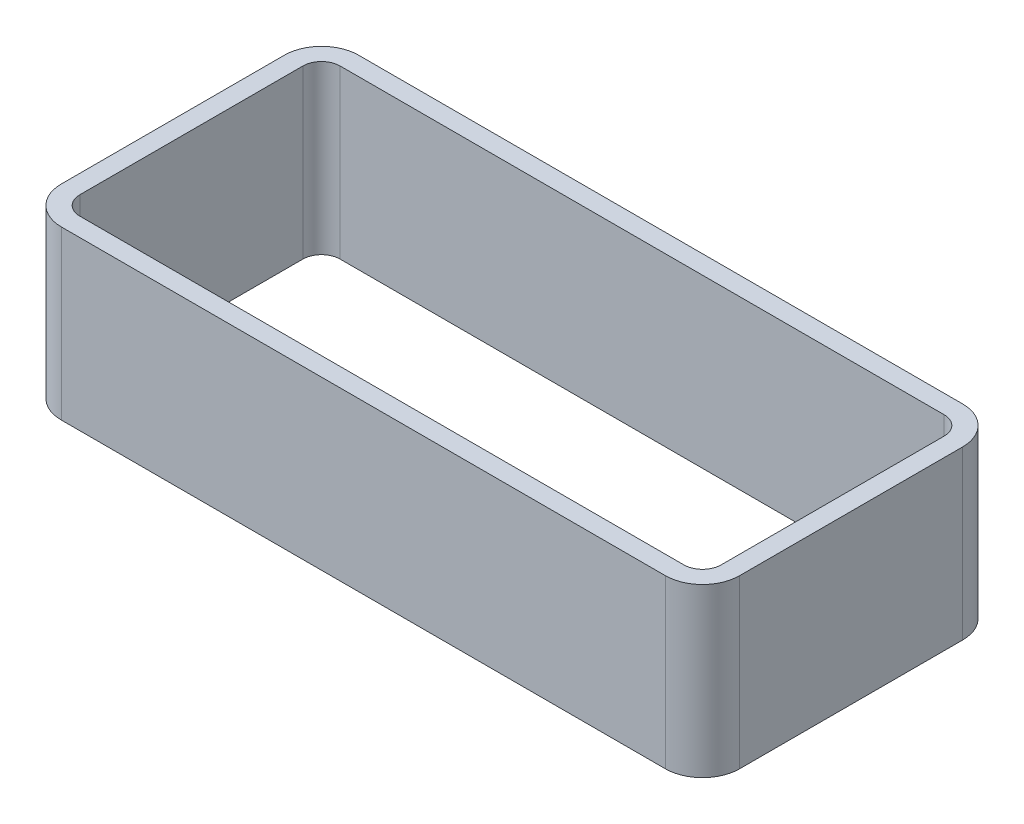
ISO-10303-21;
HEADER;
FILE_DESCRIPTION(('STEP AP214'),'2;1');
FILE_NAME('part.step','',(''),(''),'','','');
FILE_SCHEMA(('AUTOMOTIVE_DESIGN { 1 0 10303 214 1 1 1 1 }'));
ENDSEC;
DATA;
#1=APPLICATION_CONTEXT('core data for automotive mechanical design processes');
#2=APPLICATION_PROTOCOL_DEFINITION('international standard','automotive_design',2000,#1);
#3=PRODUCT_CONTEXT('',#1,'mechanical');
#4=PRODUCT('Part','Part','',(#3));
#5=PRODUCT_RELATED_PRODUCT_CATEGORY('part','',(#4));
#6=PRODUCT_DEFINITION_FORMATION('','',#4);
#7=PRODUCT_DEFINITION_CONTEXT('part definition',#1,'design');
#8=PRODUCT_DEFINITION('design','',#6,#7);
#9=PRODUCT_DEFINITION_SHAPE('','',#8);
#10=(LENGTH_UNIT() NAMED_UNIT(*) SI_UNIT(.MILLI.,.METRE.));
#11=(NAMED_UNIT(*) PLANE_ANGLE_UNIT() SI_UNIT($,.RADIAN.));
#12=(NAMED_UNIT(*) SI_UNIT($,.STERADIAN.) SOLID_ANGLE_UNIT());
#13=UNCERTAINTY_MEASURE_WITH_UNIT(LENGTH_MEASURE(1.E-05),#10,'distance_accuracy_value','');
#14=(GEOMETRIC_REPRESENTATION_CONTEXT(3) GLOBAL_UNCERTAINTY_ASSIGNED_CONTEXT((#13)) GLOBAL_UNIT_ASSIGNED_CONTEXT((#10,
#11,#12)) REPRESENTATION_CONTEXT('',''));
#15=CARTESIAN_POINT('',(0.,0.,0.));
#16=DIRECTION('',(0.,0.,1.));
#17=DIRECTION('',(1.,0.,0.));
#18=AXIS2_PLACEMENT_3D('',#15,#16,#17);
#19=CARTESIAN_POINT('',(-32.5,18.,12.));
#20=DIRECTION('',(0.,-1.,0.));
#21=DIRECTION('',(0.,0.,-1.));
#22=AXIS2_PLACEMENT_3D('',#19,#20,#21);
#23=PLANE('',#22);
#24=CARTESIAN_POINT('',(-32.5,18.,12.));
#25=DIRECTION('',(0.,1.,0.));
#26=DIRECTION('',(0.,0.,-1.));
#27=AXIS2_PLACEMENT_3D('',#24,#25,#26);
#28=CIRCLE('',#27,4.);
#29=CARTESIAN_POINT('',(-36.5,18.,12.));
#30=VERTEX_POINT('',#29);
#31=CARTESIAN_POINT('',(-32.5,18.,16.));
#32=VERTEX_POINT('',#31);
#33=EDGE_CURVE('E211',#30,#32,#28,.T.);
#34=ORIENTED_EDGE('',*,*,#33,.T.);
#35=DIRECTION('',(1.,0.,0.));
#36=VECTOR('',#35,1.);
#37=CARTESIAN_POINT('',(-32.5,18.,16.));
#38=LINE('',#37,#36);
#39=CARTESIAN_POINT('',(32.5,18.,16.));
#40=VERTEX_POINT('',#39);
#41=EDGE_CURVE('E214',#32,#40,#38,.T.);
#42=ORIENTED_EDGE('',*,*,#41,.T.);
#43=CARTESIAN_POINT('',(32.5,18.,12.));
#44=DIRECTION('',(0.,1.,0.));
#45=DIRECTION('',(0.,0.,-1.));
#46=AXIS2_PLACEMENT_3D('',#43,#44,#45);
#47=CIRCLE('',#46,4.);
#48=CARTESIAN_POINT('',(36.5,18.,12.));
#49=VERTEX_POINT('',#48);
#50=EDGE_CURVE('E217',#40,#49,#47,.T.);
#51=ORIENTED_EDGE('',*,*,#50,.T.);
#52=DIRECTION('',(0.,0.,-1.));
#53=VECTOR('',#52,1.);
#54=CARTESIAN_POINT('',(36.5,18.,12.));
#55=LINE('',#54,#53);
#56=CARTESIAN_POINT('',(36.5,18.,-12.));
#57=VERTEX_POINT('',#56);
#58=EDGE_CURVE('E219',#49,#57,#55,.T.);
#59=ORIENTED_EDGE('',*,*,#58,.T.);
#60=CARTESIAN_POINT('',(32.5,18.,-12.));
#61=DIRECTION('',(0.,1.,0.));
#62=DIRECTION('',(0.,0.,1.));
#63=AXIS2_PLACEMENT_3D('',#60,#61,#62);
#64=CIRCLE('',#63,4.);
#65=CARTESIAN_POINT('',(32.5,18.,-16.));
#66=VERTEX_POINT('',#65);
#67=EDGE_CURVE('E221',#57,#66,#64,.T.);
#68=ORIENTED_EDGE('',*,*,#67,.T.);
#69=DIRECTION('',(-1.,0.,0.));
#70=VECTOR('',#69,1.);
#71=CARTESIAN_POINT('',(-32.5,18.,-16.));
#72=LINE('',#71,#70);
#73=CARTESIAN_POINT('',(-32.5,18.,-16.));
#74=VERTEX_POINT('',#73);
#75=EDGE_CURVE('E223',#66,#74,#72,.T.);
#76=ORIENTED_EDGE('',*,*,#75,.T.);
#77=CARTESIAN_POINT('',(-32.5,18.,-12.));
#78=DIRECTION('',(0.,1.,0.));
#79=DIRECTION('',(0.,0.,1.));
#80=AXIS2_PLACEMENT_3D('',#77,#78,#79);
#81=CIRCLE('',#80,4.);
#82=CARTESIAN_POINT('',(-36.5,18.,-12.));
#83=VERTEX_POINT('',#82);
#84=EDGE_CURVE('E225',#74,#83,#81,.T.);
#85=ORIENTED_EDGE('',*,*,#84,.T.);
#86=DIRECTION('',(0.,0.,1.));
#87=VECTOR('',#86,1.);
#88=CARTESIAN_POINT('',(-36.5,18.,12.));
#89=LINE('',#88,#87);
#90=EDGE_CURVE('E227',#83,#30,#89,.T.);
#91=ORIENTED_EDGE('',*,*,#90,.T.);
#92=EDGE_LOOP('',(#34,#42,#51,#59,#68,#76,#85,#91));
#93=FACE_BOUND('',#92,.T.);
#94=CARTESIAN_POINT('',(-32.5,18.,-12.));
#95=DIRECTION('',(0.,1.,0.));
#96=DIRECTION('',(0.,0.,1.));
#97=AXIS2_PLACEMENT_3D('',#94,#95,#96);
#98=CIRCLE('',#97,2.);
#99=CARTESIAN_POINT('',(-32.5,18.,-14.));
#100=VERTEX_POINT('',#99);
#101=CARTESIAN_POINT('',(-34.5,18.,-12.));
#102=VERTEX_POINT('',#101);
#103=EDGE_CURVE('E146',#100,#102,#98,.T.);
#104=ORIENTED_EDGE('',*,*,#103,.F.);
#105=DIRECTION('',(-1.,0.,0.));
#106=VECTOR('',#105,1.);
#107=CARTESIAN_POINT('',(-32.5,18.,-14.));
#108=LINE('',#107,#106);
#109=CARTESIAN_POINT('',(32.5,18.,-14.));
#110=VERTEX_POINT('',#109);
#111=EDGE_CURVE('E179',#110,#100,#108,.T.);
#112=ORIENTED_EDGE('',*,*,#111,.F.);
#113=CARTESIAN_POINT('',(32.5,18.,-12.));
#114=DIRECTION('',(0.,1.,0.));
#115=DIRECTION('',(0.,0.,1.));
#116=AXIS2_PLACEMENT_3D('',#113,#114,#115);
#117=CIRCLE('',#116,2.);
#118=CARTESIAN_POINT('',(34.5,18.,-12.));
#119=VERTEX_POINT('',#118);
#120=EDGE_CURVE('E177',#119,#110,#117,.T.);
#121=ORIENTED_EDGE('',*,*,#120,.F.);
#122=DIRECTION('',(0.,0.,-1.));
#123=VECTOR('',#122,1.);
#124=CARTESIAN_POINT('',(34.5,18.,12.));
#125=LINE('',#124,#123);
#126=CARTESIAN_POINT('',(34.5,18.,12.));
#127=VERTEX_POINT('',#126);
#128=EDGE_CURVE('E175',#127,#119,#125,.T.);
#129=ORIENTED_EDGE('',*,*,#128,.F.);
#130=CARTESIAN_POINT('',(32.5,18.,12.));
#131=DIRECTION('',(0.,1.,0.));
#132=DIRECTION('',(0.,0.,-1.));
#133=AXIS2_PLACEMENT_3D('',#130,#131,#132);
#134=CIRCLE('',#133,2.);
#135=CARTESIAN_POINT('',(32.5,18.,14.));
#136=VERTEX_POINT('',#135);
#137=EDGE_CURVE('E173',#136,#127,#134,.T.);
#138=ORIENTED_EDGE('',*,*,#137,.F.);
#139=DIRECTION('',(1.,0.,0.));
#140=VECTOR('',#139,1.);
#141=CARTESIAN_POINT('',(-32.5,18.,14.));
#142=LINE('',#141,#140);
#143=CARTESIAN_POINT('',(-32.5,18.,14.));
#144=VERTEX_POINT('',#143);
#145=EDGE_CURVE('E169',#144,#136,#142,.T.);
#146=ORIENTED_EDGE('',*,*,#145,.F.);
#147=CARTESIAN_POINT('',(-32.5,18.,12.));
#148=DIRECTION('',(0.,1.,0.));
#149=DIRECTION('',(0.,0.,-1.));
#150=AXIS2_PLACEMENT_3D('',#147,#148,#149);
#151=CIRCLE('',#150,2.);
#152=CARTESIAN_POINT('',(-34.5,18.,12.));
#153=VERTEX_POINT('',#152);
#154=EDGE_CURVE('E167',#153,#144,#151,.T.);
#155=ORIENTED_EDGE('',*,*,#154,.F.);
#156=DIRECTION('',(0.,0.,1.));
#157=VECTOR('',#156,1.);
#158=CARTESIAN_POINT('',(-34.5,18.,12.));
#159=LINE('',#158,#157);
#160=EDGE_CURVE('E154',#102,#153,#159,.T.);
#161=ORIENTED_EDGE('',*,*,#160,.F.);
#162=EDGE_LOOP('',(#104,#112,#121,#129,#138,#146,#155,#161));
#163=FACE_BOUND('',#162,.T.);
#164=ADVANCED_FACE('F33',(#93,#163),#23,.F.);
#165=CARTESIAN_POINT('',(-32.5,0.,12.));
#166=DIRECTION('',(0.,-1.,0.));
#167=DIRECTION('',(0.,0.,-1.));
#168=AXIS2_PLACEMENT_3D('',#165,#166,#167);
#169=PLANE('',#168);
#170=CARTESIAN_POINT('',(-32.5,0.,12.));
#171=DIRECTION('',(0.,1.,0.));
#172=DIRECTION('',(0.,0.,-1.));
#173=AXIS2_PLACEMENT_3D('',#170,#171,#172);
#174=CIRCLE('',#173,4.);
#175=CARTESIAN_POINT('',(-36.5,0.,12.));
#176=VERTEX_POINT('',#175);
#177=CARTESIAN_POINT('',(-32.5,0.,16.));
#178=VERTEX_POINT('',#177);
#179=EDGE_CURVE('E162',#176,#178,#174,.T.);
#180=ORIENTED_EDGE('',*,*,#179,.F.);
#181=DIRECTION('',(0.,0.,1.));
#182=VECTOR('',#181,1.);
#183=CARTESIAN_POINT('',(-36.5,0.,12.));
#184=LINE('',#183,#182);
#185=CARTESIAN_POINT('',(-36.5,0.,-12.));
#186=VERTEX_POINT('',#185);
#187=EDGE_CURVE('E215',#186,#176,#184,.T.);
#188=ORIENTED_EDGE('',*,*,#187,.F.);
#189=CARTESIAN_POINT('',(-32.5,0.,-12.));
#190=DIRECTION('',(0.,1.,0.));
#191=DIRECTION('',(0.,0.,1.));
#192=AXIS2_PLACEMENT_3D('',#189,#190,#191);
#193=CIRCLE('',#192,4.);
#194=CARTESIAN_POINT('',(-32.5,0.,-16.));
#195=VERTEX_POINT('',#194);
#196=EDGE_CURVE('E242',#195,#186,#193,.T.);
#197=ORIENTED_EDGE('',*,*,#196,.F.);
#198=DIRECTION('',(-1.,0.,0.));
#199=VECTOR('',#198,1.);
#200=CARTESIAN_POINT('',(-32.5,0.,-16.));
#201=LINE('',#200,#199);
#202=CARTESIAN_POINT('',(32.5,0.,-16.));
#203=VERTEX_POINT('',#202);
#204=EDGE_CURVE('E240',#203,#195,#201,.T.);
#205=ORIENTED_EDGE('',*,*,#204,.F.);
#206=CARTESIAN_POINT('',(32.5,0.,-12.));
#207=DIRECTION('',(0.,1.,0.));
#208=DIRECTION('',(0.,0.,1.));
#209=AXIS2_PLACEMENT_3D('',#206,#207,#208);
#210=CIRCLE('',#209,4.);
#211=CARTESIAN_POINT('',(36.5,0.,-12.));
#212=VERTEX_POINT('',#211);
#213=EDGE_CURVE('E238',#212,#203,#210,.T.);
#214=ORIENTED_EDGE('',*,*,#213,.F.);
#215=DIRECTION('',(0.,0.,-1.));
#216=VECTOR('',#215,1.);
#217=CARTESIAN_POINT('',(36.5,0.,12.));
#218=LINE('',#217,#216);
#219=CARTESIAN_POINT('',(36.5,0.,12.));
#220=VERTEX_POINT('',#219);
#221=EDGE_CURVE('E236',#220,#212,#218,.T.);
#222=ORIENTED_EDGE('',*,*,#221,.F.);
#223=CARTESIAN_POINT('',(32.5,0.,12.));
#224=DIRECTION('',(0.,1.,0.));
#225=DIRECTION('',(0.,0.,-1.));
#226=AXIS2_PLACEMENT_3D('',#223,#224,#225);
#227=CIRCLE('',#226,4.);
#228=CARTESIAN_POINT('',(32.5,0.,16.));
#229=VERTEX_POINT('',#228);
#230=EDGE_CURVE('E234',#229,#220,#227,.T.);
#231=ORIENTED_EDGE('',*,*,#230,.F.);
#232=DIRECTION('',(1.,0.,0.));
#233=VECTOR('',#232,1.);
#234=CARTESIAN_POINT('',(-32.5,0.,16.));
#235=LINE('',#234,#233);
#236=EDGE_CURVE('E232',#178,#229,#235,.T.);
#237=ORIENTED_EDGE('',*,*,#236,.F.);
#238=EDGE_LOOP('',(#180,#188,#197,#205,#214,#222,#231,#237));
#239=FACE_BOUND('',#238,.T.);
#240=DIRECTION('',(-1.,0.,0.));
#241=VECTOR('',#240,1.);
#242=CARTESIAN_POINT('',(-32.5,0.,-14.));
#243=LINE('',#242,#241);
#244=CARTESIAN_POINT('',(32.5,0.,-14.));
#245=VERTEX_POINT('',#244);
#246=CARTESIAN_POINT('',(-32.5,0.,-14.));
#247=VERTEX_POINT('',#246);
#248=EDGE_CURVE('E155',#245,#247,#243,.T.);
#249=ORIENTED_EDGE('',*,*,#248,.T.);
#250=CARTESIAN_POINT('',(-32.5,0.,-12.));
#251=DIRECTION('',(0.,1.,0.));
#252=DIRECTION('',(0.,0.,1.));
#253=AXIS2_PLACEMENT_3D('',#250,#251,#252);
#254=CIRCLE('',#253,2.);
#255=CARTESIAN_POINT('',(-34.5,0.,-12.));
#256=VERTEX_POINT('',#255);
#257=EDGE_CURVE('E56',#247,#256,#254,.T.);
#258=ORIENTED_EDGE('',*,*,#257,.T.);
#259=DIRECTION('',(0.,0.,1.));
#260=VECTOR('',#259,1.);
#261=CARTESIAN_POINT('',(-34.5,0.,12.));
#262=LINE('',#261,#260);
#263=CARTESIAN_POINT('',(-34.5,0.,12.));
#264=VERTEX_POINT('',#263);
#265=EDGE_CURVE('E161',#256,#264,#262,.T.);
#266=ORIENTED_EDGE('',*,*,#265,.T.);
#267=CARTESIAN_POINT('',(-32.5,0.,12.));
#268=DIRECTION('',(0.,1.,0.));
#269=DIRECTION('',(0.,0.,-1.));
#270=AXIS2_PLACEMENT_3D('',#267,#268,#269);
#271=CIRCLE('',#270,2.);
#272=CARTESIAN_POINT('',(-32.5,0.,14.));
#273=VERTEX_POINT('',#272);
#274=EDGE_CURVE('E183',#264,#273,#271,.T.);
#275=ORIENTED_EDGE('',*,*,#274,.T.);
#276=DIRECTION('',(1.,0.,0.));
#277=VECTOR('',#276,1.);
#278=CARTESIAN_POINT('',(-32.5,0.,14.));
#279=LINE('',#278,#277);
#280=CARTESIAN_POINT('',(32.5,0.,14.));
#281=VERTEX_POINT('',#280);
#282=EDGE_CURVE('E186',#273,#281,#279,.T.);
#283=ORIENTED_EDGE('',*,*,#282,.T.);
#284=CARTESIAN_POINT('',(32.5,0.,12.));
#285=DIRECTION('',(0.,1.,0.));
#286=DIRECTION('',(0.,0.,-1.));
#287=AXIS2_PLACEMENT_3D('',#284,#285,#286);
#288=CIRCLE('',#287,2.);
#289=CARTESIAN_POINT('',(34.5,0.,12.));
#290=VERTEX_POINT('',#289);
#291=EDGE_CURVE('E189',#281,#290,#288,.T.);
#292=ORIENTED_EDGE('',*,*,#291,.T.);
#293=DIRECTION('',(0.,0.,-1.));
#294=VECTOR('',#293,1.);
#295=CARTESIAN_POINT('',(34.5,0.,12.));
#296=LINE('',#295,#294);
#297=CARTESIAN_POINT('',(34.5,0.,-12.));
#298=VERTEX_POINT('',#297);
#299=EDGE_CURVE('E192',#290,#298,#296,.T.);
#300=ORIENTED_EDGE('',*,*,#299,.T.);
#301=CARTESIAN_POINT('',(32.5,0.,-12.));
#302=DIRECTION('',(0.,1.,0.));
#303=DIRECTION('',(0.,0.,1.));
#304=AXIS2_PLACEMENT_3D('',#301,#302,#303);
#305=CIRCLE('',#304,2.);
#306=EDGE_CURVE('E195',#298,#245,#305,.T.);
#307=ORIENTED_EDGE('',*,*,#306,.T.);
#308=EDGE_LOOP('',(#249,#258,#266,#275,#283,#292,#300,#307));
#309=FACE_BOUND('',#308,.T.);
#310=ADVANCED_FACE('F272',(#239,#309),#169,.T.);
#311=CARTESIAN_POINT('',(-32.5,18.,12.));
#312=DIRECTION('',(0.,-1.,0.));
#313=DIRECTION('',(0.,0.,-1.));
#314=AXIS2_PLACEMENT_3D('',#311,#312,#313);
#315=CYLINDRICAL_SURFACE('',#314,4.);
#316=ORIENTED_EDGE('',*,*,#179,.T.);
#317=DIRECTION('',(0.,-1.,0.));
#318=VECTOR('',#317,1.);
#319=CARTESIAN_POINT('',(-32.5,18.,16.));
#320=LINE('',#319,#318);
#321=EDGE_CURVE('E11',#32,#178,#320,.T.);
#322=ORIENTED_EDGE('',*,*,#321,.F.);
#323=ORIENTED_EDGE('',*,*,#33,.F.);
#324=DIRECTION('',(0.,-1.,0.));
#325=VECTOR('',#324,1.);
#326=CARTESIAN_POINT('',(-36.5,18.,12.));
#327=LINE('',#326,#325);
#328=EDGE_CURVE('E229',#30,#176,#327,.T.);
#329=ORIENTED_EDGE('',*,*,#328,.T.);
#330=EDGE_LOOP('',(#316,#322,#323,#329));
#331=FACE_BOUND('',#330,.T.);
#332=ADVANCED_FACE('F35',(#331),#315,.T.);
#333=CARTESIAN_POINT('',(-32.5,18.,16.));
#334=DIRECTION('',(0.,0.,-1.));
#335=DIRECTION('',(-1.,0.,0.));
#336=AXIS2_PLACEMENT_3D('',#333,#334,#335);
#337=PLANE('',#336);
#338=ORIENTED_EDGE('',*,*,#236,.T.);
#339=DIRECTION('',(0.,-1.,0.));
#340=VECTOR('',#339,1.);
#341=CARTESIAN_POINT('',(32.5,18.,16.));
#342=LINE('',#341,#340);
#343=EDGE_CURVE('E41',#40,#229,#342,.T.);
#344=ORIENTED_EDGE('',*,*,#343,.F.);
#345=ORIENTED_EDGE('',*,*,#41,.F.);
#346=ORIENTED_EDGE('',*,*,#321,.T.);
#347=EDGE_LOOP('',(#338,#344,#345,#346));
#348=FACE_BOUND('',#347,.T.);
#349=ADVANCED_FACE('F289',(#348),#337,.F.);
#350=CARTESIAN_POINT('',(32.5,18.,12.));
#351=DIRECTION('',(0.,-1.,0.));
#352=DIRECTION('',(0.,0.,-1.));
#353=AXIS2_PLACEMENT_3D('',#350,#351,#352);
#354=CYLINDRICAL_SURFACE('',#353,4.);
#355=ORIENTED_EDGE('',*,*,#230,.T.);
#356=DIRECTION('',(0.,-1.,0.));
#357=VECTOR('',#356,1.);
#358=CARTESIAN_POINT('',(36.5,18.,12.));
#359=LINE('',#358,#357);
#360=EDGE_CURVE('E259',#49,#220,#359,.T.);
#361=ORIENTED_EDGE('',*,*,#360,.F.);
#362=ORIENTED_EDGE('',*,*,#50,.F.);
#363=ORIENTED_EDGE('',*,*,#343,.T.);
#364=EDGE_LOOP('',(#355,#361,#362,#363));
#365=FACE_BOUND('',#364,.T.);
#366=ADVANCED_FACE('F266',(#365),#354,.T.);
#367=CARTESIAN_POINT('',(36.5,18.,12.));
#368=DIRECTION('',(-1.,0.,0.));
#369=DIRECTION('',(0.,0.,1.));
#370=AXIS2_PLACEMENT_3D('',#367,#368,#369);
#371=PLANE('',#370);
#372=ORIENTED_EDGE('',*,*,#221,.T.);
#373=DIRECTION('',(0.,-1.,0.));
#374=VECTOR('',#373,1.);
#375=CARTESIAN_POINT('',(36.5,18.,-12.));
#376=LINE('',#375,#374);
#377=EDGE_CURVE('E256',#57,#212,#376,.T.);
#378=ORIENTED_EDGE('',*,*,#377,.F.);
#379=ORIENTED_EDGE('',*,*,#58,.F.);
#380=ORIENTED_EDGE('',*,*,#360,.T.);
#381=EDGE_LOOP('',(#372,#378,#379,#380));
#382=FACE_BOUND('',#381,.T.);
#383=ADVANCED_FACE('F278',(#382),#371,.F.);
#384=CARTESIAN_POINT('',(32.5,18.,-12.));
#385=DIRECTION('',(0.,-1.,0.));
#386=DIRECTION('',(0.,0.,-1.));
#387=AXIS2_PLACEMENT_3D('',#384,#385,#386);
#388=CYLINDRICAL_SURFACE('',#387,4.);
#389=ORIENTED_EDGE('',*,*,#213,.T.);
#390=DIRECTION('',(0.,-1.,0.));
#391=VECTOR('',#390,1.);
#392=CARTESIAN_POINT('',(32.5,18.,-16.));
#393=LINE('',#392,#391);
#394=EDGE_CURVE('E253',#66,#203,#393,.T.);
#395=ORIENTED_EDGE('',*,*,#394,.F.);
#396=ORIENTED_EDGE('',*,*,#67,.F.);
#397=ORIENTED_EDGE('',*,*,#377,.T.);
#398=EDGE_LOOP('',(#389,#395,#396,#397));
#399=FACE_BOUND('',#398,.T.);
#400=ADVANCED_FACE('F282',(#399),#388,.T.);
#401=CARTESIAN_POINT('',(-32.5,18.,-16.));
#402=DIRECTION('',(0.,0.,1.));
#403=DIRECTION('',(1.,0.,0.));
#404=AXIS2_PLACEMENT_3D('',#401,#402,#403);
#405=PLANE('',#404);
#406=ORIENTED_EDGE('',*,*,#204,.T.);
#407=DIRECTION('',(0.,-1.,0.));
#408=VECTOR('',#407,1.);
#409=CARTESIAN_POINT('',(-32.5,18.,-16.));
#410=LINE('',#409,#408);
#411=EDGE_CURVE('E250',#74,#195,#410,.T.);
#412=ORIENTED_EDGE('',*,*,#411,.F.);
#413=ORIENTED_EDGE('',*,*,#75,.F.);
#414=ORIENTED_EDGE('',*,*,#394,.T.);
#415=EDGE_LOOP('',(#406,#412,#413,#414));
#416=FACE_BOUND('',#415,.T.);
#417=ADVANCED_FACE('F302',(#416),#405,.F.);
#418=CARTESIAN_POINT('',(-32.5,18.,-12.));
#419=DIRECTION('',(0.,-1.,0.));
#420=DIRECTION('',(0.,0.,-1.));
#421=AXIS2_PLACEMENT_3D('',#418,#419,#420);
#422=CYLINDRICAL_SURFACE('',#421,4.);
#423=ORIENTED_EDGE('',*,*,#196,.T.);
#424=DIRECTION('',(0.,-1.,0.));
#425=VECTOR('',#424,1.);
#426=CARTESIAN_POINT('',(-36.5,18.,-12.));
#427=LINE('',#426,#425);
#428=EDGE_CURVE('E247',#83,#186,#427,.T.);
#429=ORIENTED_EDGE('',*,*,#428,.F.);
#430=ORIENTED_EDGE('',*,*,#84,.F.);
#431=ORIENTED_EDGE('',*,*,#411,.T.);
#432=EDGE_LOOP('',(#423,#429,#430,#431));
#433=FACE_BOUND('',#432,.T.);
#434=ADVANCED_FACE('F300',(#433),#422,.T.);
#435=CARTESIAN_POINT('',(-36.5,18.,12.));
#436=DIRECTION('',(1.,0.,0.));
#437=DIRECTION('',(0.,0.,-1.));
#438=AXIS2_PLACEMENT_3D('',#435,#436,#437);
#439=PLANE('',#438);
#440=ORIENTED_EDGE('',*,*,#187,.T.);
#441=ORIENTED_EDGE('',*,*,#328,.F.);
#442=ORIENTED_EDGE('',*,*,#90,.F.);
#443=ORIENTED_EDGE('',*,*,#428,.T.);
#444=EDGE_LOOP('',(#440,#441,#442,#443));
#445=FACE_BOUND('',#444,.T.);
#446=ADVANCED_FACE('F295',(#445),#439,.F.);
#447=CARTESIAN_POINT('',(-32.5,18.,-12.));
#448=DIRECTION('',(0.,-1.,0.));
#449=DIRECTION('',(0.,0.,-1.));
#450=AXIS2_PLACEMENT_3D('',#447,#448,#449);
#451=CYLINDRICAL_SURFACE('',#450,2.);
#452=ORIENTED_EDGE('',*,*,#257,.F.);
#453=DIRECTION('',(0.,-1.,0.));
#454=VECTOR('',#453,1.);
#455=CARTESIAN_POINT('',(-32.5,18.,-14.));
#456=LINE('',#455,#454);
#457=EDGE_CURVE('E150',#100,#247,#456,.T.);
#458=ORIENTED_EDGE('',*,*,#457,.F.);
#459=ORIENTED_EDGE('',*,*,#103,.T.);
#460=DIRECTION('',(0.,-1.,0.));
#461=VECTOR('',#460,1.);
#462=CARTESIAN_POINT('',(-34.5,18.,-12.));
#463=LINE('',#462,#461);
#464=EDGE_CURVE('E149',#102,#256,#463,.T.);
#465=ORIENTED_EDGE('',*,*,#464,.T.);
#466=EDGE_LOOP('',(#452,#458,#459,#465));
#467=FACE_BOUND('',#466,.T.);
#468=ADVANCED_FACE('F148',(#467),#451,.F.);
#469=CARTESIAN_POINT('',(-34.5,18.,12.));
#470=DIRECTION('',(1.,0.,0.));
#471=DIRECTION('',(0.,0.,-1.));
#472=AXIS2_PLACEMENT_3D('',#469,#470,#471);
#473=PLANE('',#472);
#474=ORIENTED_EDGE('',*,*,#265,.F.);
#475=ORIENTED_EDGE('',*,*,#464,.F.);
#476=ORIENTED_EDGE('',*,*,#160,.T.);
#477=DIRECTION('',(0.,-1.,0.));
#478=VECTOR('',#477,1.);
#479=CARTESIAN_POINT('',(-34.5,18.,12.));
#480=LINE('',#479,#478);
#481=EDGE_CURVE('E163',#153,#264,#480,.T.);
#482=ORIENTED_EDGE('',*,*,#481,.T.);
#483=EDGE_LOOP('',(#474,#475,#476,#482));
#484=FACE_BOUND('',#483,.T.);
#485=ADVANCED_FACE('F158',(#484),#473,.T.);
#486=CARTESIAN_POINT('',(-32.5,18.,12.));
#487=DIRECTION('',(0.,-1.,0.));
#488=DIRECTION('',(0.,0.,-1.));
#489=AXIS2_PLACEMENT_3D('',#486,#487,#488);
#490=CYLINDRICAL_SURFACE('',#489,2.);
#491=ORIENTED_EDGE('',*,*,#274,.F.);
#492=ORIENTED_EDGE('',*,*,#481,.F.);
#493=ORIENTED_EDGE('',*,*,#154,.T.);
#494=DIRECTION('',(0.,-1.,0.));
#495=VECTOR('',#494,1.);
#496=CARTESIAN_POINT('',(-32.5,18.,14.));
#497=LINE('',#496,#495);
#498=EDGE_CURVE('E208',#144,#273,#497,.T.);
#499=ORIENTED_EDGE('',*,*,#498,.T.);
#500=EDGE_LOOP('',(#491,#492,#493,#499));
#501=FACE_BOUND('',#500,.T.);
#502=ADVANCED_FACE('F327',(#501),#490,.F.);
#503=CARTESIAN_POINT('',(-32.5,18.,14.));
#504=DIRECTION('',(0.,0.,-1.));
#505=DIRECTION('',(-1.,0.,0.));
#506=AXIS2_PLACEMENT_3D('',#503,#504,#505);
#507=PLANE('',#506);
#508=ORIENTED_EDGE('',*,*,#282,.F.);
#509=ORIENTED_EDGE('',*,*,#498,.F.);
#510=ORIENTED_EDGE('',*,*,#145,.T.);
#511=DIRECTION('',(0.,-1.,0.));
#512=VECTOR('',#511,1.);
#513=CARTESIAN_POINT('',(32.5,18.,14.));
#514=LINE('',#513,#512);
#515=EDGE_CURVE('E206',#136,#281,#514,.T.);
#516=ORIENTED_EDGE('',*,*,#515,.T.);
#517=EDGE_LOOP('',(#508,#509,#510,#516));
#518=FACE_BOUND('',#517,.T.);
#519=ADVANCED_FACE('F331',(#518),#507,.T.);
#520=CARTESIAN_POINT('',(32.5,18.,12.));
#521=DIRECTION('',(0.,-1.,0.));
#522=DIRECTION('',(0.,0.,-1.));
#523=AXIS2_PLACEMENT_3D('',#520,#521,#522);
#524=CYLINDRICAL_SURFACE('',#523,2.);
#525=ORIENTED_EDGE('',*,*,#291,.F.);
#526=ORIENTED_EDGE('',*,*,#515,.F.);
#527=ORIENTED_EDGE('',*,*,#137,.T.);
#528=DIRECTION('',(0.,-1.,0.));
#529=VECTOR('',#528,1.);
#530=CARTESIAN_POINT('',(34.5,18.,12.));
#531=LINE('',#530,#529);
#532=EDGE_CURVE('E204',#127,#290,#531,.T.);
#533=ORIENTED_EDGE('',*,*,#532,.T.);
#534=EDGE_LOOP('',(#525,#526,#527,#533));
#535=FACE_BOUND('',#534,.T.);
#536=ADVANCED_FACE('F337',(#535),#524,.F.);
#537=CARTESIAN_POINT('',(34.5,18.,12.));
#538=DIRECTION('',(-1.,0.,0.));
#539=DIRECTION('',(0.,0.,1.));
#540=AXIS2_PLACEMENT_3D('',#537,#538,#539);
#541=PLANE('',#540);
#542=ORIENTED_EDGE('',*,*,#299,.F.);
#543=ORIENTED_EDGE('',*,*,#532,.F.);
#544=ORIENTED_EDGE('',*,*,#128,.T.);
#545=DIRECTION('',(0.,-1.,0.));
#546=VECTOR('',#545,1.);
#547=CARTESIAN_POINT('',(34.5,18.,-12.));
#548=LINE('',#547,#546);
#549=EDGE_CURVE('E202',#119,#298,#548,.T.);
#550=ORIENTED_EDGE('',*,*,#549,.T.);
#551=EDGE_LOOP('',(#542,#543,#544,#550));
#552=FACE_BOUND('',#551,.T.);
#553=ADVANCED_FACE('F341',(#552),#541,.T.);
#554=CARTESIAN_POINT('',(32.5,18.,-12.));
#555=DIRECTION('',(0.,-1.,0.));
#556=DIRECTION('',(0.,0.,-1.));
#557=AXIS2_PLACEMENT_3D('',#554,#555,#556);
#558=CYLINDRICAL_SURFACE('',#557,2.);
#559=ORIENTED_EDGE('',*,*,#306,.F.);
#560=ORIENTED_EDGE('',*,*,#549,.F.);
#561=ORIENTED_EDGE('',*,*,#120,.T.);
#562=DIRECTION('',(0.,-1.,0.));
#563=VECTOR('',#562,1.);
#564=CARTESIAN_POINT('',(32.5,18.,-14.));
#565=LINE('',#564,#563);
#566=EDGE_CURVE('E48',#110,#245,#565,.T.);
#567=ORIENTED_EDGE('',*,*,#566,.T.);
#568=EDGE_LOOP('',(#559,#560,#561,#567));
#569=FACE_BOUND('',#568,.T.);
#570=ADVANCED_FACE('F345',(#569),#558,.F.);
#571=CARTESIAN_POINT('',(-32.5,18.,-14.));
#572=DIRECTION('',(0.,0.,1.));
#573=DIRECTION('',(1.,0.,0.));
#574=AXIS2_PLACEMENT_3D('',#571,#572,#573);
#575=PLANE('',#574);
#576=ORIENTED_EDGE('',*,*,#248,.F.);
#577=ORIENTED_EDGE('',*,*,#566,.F.);
#578=ORIENTED_EDGE('',*,*,#111,.T.);
#579=ORIENTED_EDGE('',*,*,#457,.T.);
#580=EDGE_LOOP('',(#576,#577,#578,#579));
#581=FACE_BOUND('',#580,.T.);
#582=ADVANCED_FACE('F349',(#581),#575,.T.);
#583=CLOSED_SHELL('',(#164,#310,#332,#349,#366,#383,#400,#417,#434,#446,#468,#485,#502,#519,
#536,#553,#570,#582));
#584=MANIFOLD_SOLID_BREP('B2',#583);
#585=ADVANCED_BREP_SHAPE_REPRESENTATION('',(#18,#584),#14);
#586=SHAPE_DEFINITION_REPRESENTATION(#9,#585);
ENDSEC;
END-ISO-10303-21;
